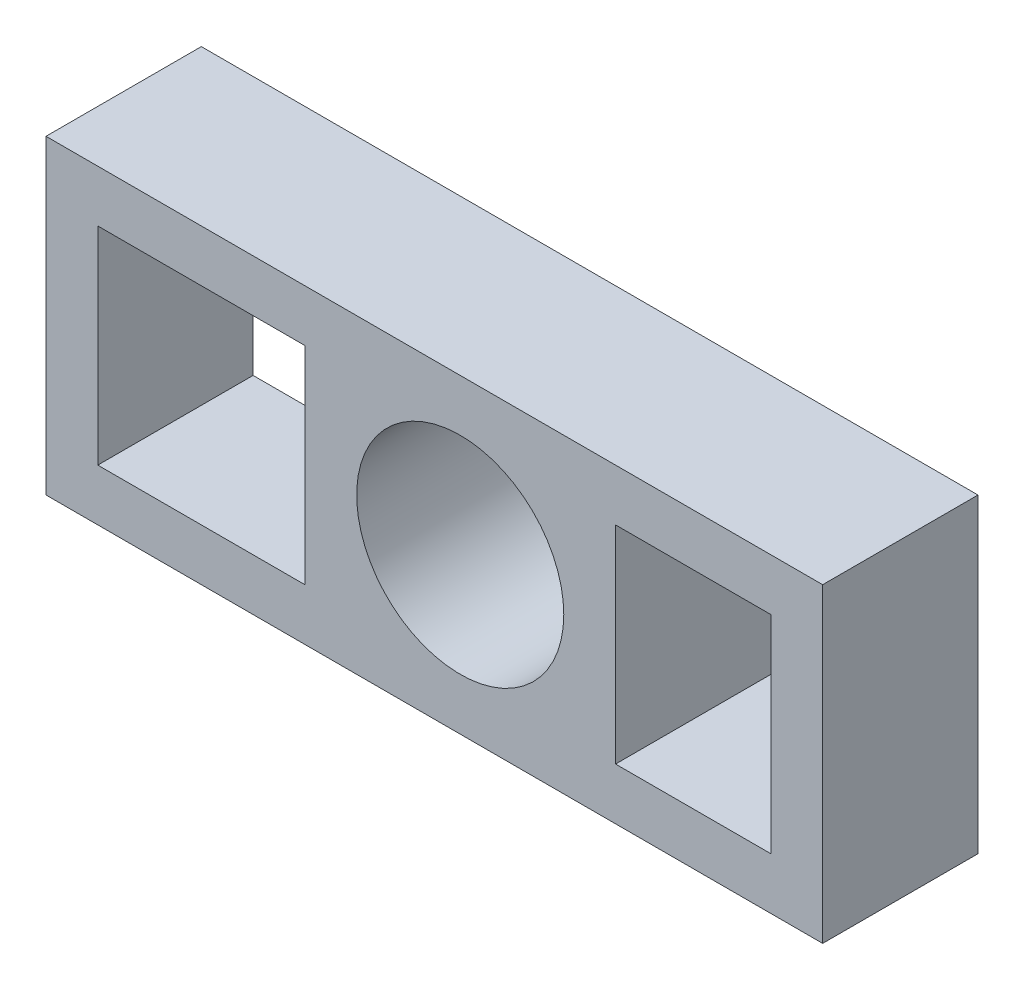
ISO-10303-21;
HEADER;
FILE_DESCRIPTION(('STEP AP214'),'2;1');
FILE_NAME('part.step','',(''),(''),'','','');
FILE_SCHEMA(('AUTOMOTIVE_DESIGN { 1 0 10303 214 1 1 1 1 }'));
ENDSEC;
DATA;
#1=APPLICATION_CONTEXT('core data for automotive mechanical design processes');
#2=APPLICATION_PROTOCOL_DEFINITION('international standard','automotive_design',2000,#1);
#3=PRODUCT_CONTEXT('',#1,'mechanical');
#4=PRODUCT('Part','Part','',(#3));
#5=PRODUCT_RELATED_PRODUCT_CATEGORY('part','',(#4));
#6=PRODUCT_DEFINITION_FORMATION('','',#4);
#7=PRODUCT_DEFINITION_CONTEXT('part definition',#1,'design');
#8=PRODUCT_DEFINITION('design','',#6,#7);
#9=PRODUCT_DEFINITION_SHAPE('','',#8);
#10=(LENGTH_UNIT() NAMED_UNIT(*) SI_UNIT(.MILLI.,.METRE.));
#11=(NAMED_UNIT(*) PLANE_ANGLE_UNIT() SI_UNIT($,.RADIAN.));
#12=(NAMED_UNIT(*) SI_UNIT($,.STERADIAN.) SOLID_ANGLE_UNIT());
#13=UNCERTAINTY_MEASURE_WITH_UNIT(LENGTH_MEASURE(1.E-05),#10,'distance_accuracy_value','');
#14=(GEOMETRIC_REPRESENTATION_CONTEXT(3) GLOBAL_UNCERTAINTY_ASSIGNED_CONTEXT((#13)) GLOBAL_UNIT_ASSIGNED_CONTEXT((#10,
#11,#12)) REPRESENTATION_CONTEXT('',''));
#15=CARTESIAN_POINT('',(0.,0.,0.));
#16=DIRECTION('',(0.,0.,1.));
#17=DIRECTION('',(1.,0.,0.));
#18=AXIS2_PLACEMENT_3D('',#15,#16,#17);
#19=CARTESIAN_POINT('',(0.,0.,381.));
#20=DIRECTION('',(0.,0.,-1.));
#21=DIRECTION('',(-1.,0.,0.));
#22=AXIS2_PLACEMENT_3D('',#19,#20,#21);
#23=PLANE('',#22);
#24=DIRECTION('',(0.,1.,0.));
#25=VECTOR('',#24,1.);
#26=CARTESIAN_POINT('',(635.,635.,381.));
#27=LINE('',#26,#25);
#28=CARTESIAN_POINT('',(635.,127.,381.));
#29=VERTEX_POINT('',#28);
#30=CARTESIAN_POINT('',(635.,635.,381.));
#31=VERTEX_POINT('',#30);
#32=EDGE_CURVE('E182',#29,#31,#27,.T.);
#33=ORIENTED_EDGE('',*,*,#32,.F.);
#34=DIRECTION('',(1.,0.,0.));
#35=VECTOR('',#34,1.);
#36=CARTESIAN_POINT('',(127.,127.,381.));
#37=LINE('',#36,#35);
#38=CARTESIAN_POINT('',(127.,127.,381.));
#39=VERTEX_POINT('',#38);
#40=EDGE_CURVE('E193',#39,#29,#37,.T.);
#41=ORIENTED_EDGE('',*,*,#40,.F.);
#42=DIRECTION('',(0.,-1.,0.));
#43=VECTOR('',#42,1.);
#44=CARTESIAN_POINT('',(127.,635.,381.));
#45=LINE('',#44,#43);
#46=CARTESIAN_POINT('',(127.,635.,381.));
#47=VERTEX_POINT('',#46);
#48=EDGE_CURVE('E189',#47,#39,#45,.T.);
#49=ORIENTED_EDGE('',*,*,#48,.F.);
#50=DIRECTION('',(-1.,0.,0.));
#51=VECTOR('',#50,1.);
#52=CARTESIAN_POINT('',(127.,635.,381.));
#53=LINE('',#52,#51);
#54=EDGE_CURVE('E185',#31,#47,#53,.T.);
#55=ORIENTED_EDGE('',*,*,#54,.F.);
#56=EDGE_LOOP('',(#33,#41,#49,#55));
#57=FACE_BOUND('',#56,.T.);
#58=DIRECTION('',(0.,-1.,0.));
#59=VECTOR('',#58,1.);
#60=CARTESIAN_POINT('',(0.,0.,381.));
#61=LINE('',#60,#59);
#62=CARTESIAN_POINT('',(0.,762.,381.));
#63=VERTEX_POINT('',#62);
#64=CARTESIAN_POINT('',(0.,0.,381.));
#65=VERTEX_POINT('',#64);
#66=EDGE_CURVE('E225',#63,#65,#61,.T.);
#67=ORIENTED_EDGE('',*,*,#66,.T.);
#68=DIRECTION('',(1.,0.,0.));
#69=VECTOR('',#68,1.);
#70=CARTESIAN_POINT('',(0.,0.,381.));
#71=LINE('',#70,#69);
#72=CARTESIAN_POINT('',(1905.,0.,381.));
#73=VERTEX_POINT('',#72);
#74=EDGE_CURVE('E229',#65,#73,#71,.T.);
#75=ORIENTED_EDGE('',*,*,#74,.T.);
#76=DIRECTION('',(0.,1.,0.));
#77=VECTOR('',#76,1.);
#78=CARTESIAN_POINT('',(1905.,0.,381.));
#79=LINE('',#78,#77);
#80=CARTESIAN_POINT('',(1905.,762.,381.));
#81=VERTEX_POINT('',#80);
#82=EDGE_CURVE('E233',#73,#81,#79,.T.);
#83=ORIENTED_EDGE('',*,*,#82,.T.);
#84=DIRECTION('',(-1.,0.,0.));
#85=VECTOR('',#84,1.);
#86=CARTESIAN_POINT('',(0.,762.,381.));
#87=LINE('',#86,#85);
#88=EDGE_CURVE('E236',#81,#63,#87,.T.);
#89=ORIENTED_EDGE('',*,*,#88,.T.);
#90=EDGE_LOOP('',(#67,#75,#83,#89));
#91=FACE_BOUND('',#90,.T.);
#92=DIRECTION('',(0.,-1.,0.));
#93=VECTOR('',#92,1.);
#94=CARTESIAN_POINT('',(1397.,635.,381.));
#95=LINE('',#94,#93);
#96=CARTESIAN_POINT('',(1397.,635.,381.));
#97=VERTEX_POINT('',#96);
#98=CARTESIAN_POINT('',(1397.,127.,381.));
#99=VERTEX_POINT('',#98);
#100=EDGE_CURVE('E131',#97,#99,#95,.T.);
#101=ORIENTED_EDGE('',*,*,#100,.F.);
#102=DIRECTION('',(-1.,0.,0.));
#103=VECTOR('',#102,1.);
#104=CARTESIAN_POINT('',(1397.,635.,381.));
#105=LINE('',#104,#103);
#106=CARTESIAN_POINT('',(1778.,635.,381.));
#107=VERTEX_POINT('',#106);
#108=EDGE_CURVE('E158',#107,#97,#105,.T.);
#109=ORIENTED_EDGE('',*,*,#108,.F.);
#110=DIRECTION('',(0.,1.,0.));
#111=VECTOR('',#110,1.);
#112=CARTESIAN_POINT('',(1778.,635.,381.));
#113=LINE('',#112,#111);
#114=CARTESIAN_POINT('',(1778.,127.,381.));
#115=VERTEX_POINT('',#114);
#116=EDGE_CURVE('E154',#115,#107,#113,.T.);
#117=ORIENTED_EDGE('',*,*,#116,.F.);
#118=DIRECTION('',(1.,0.,0.));
#119=VECTOR('',#118,1.);
#120=CARTESIAN_POINT('',(1397.,127.,381.));
#121=LINE('',#120,#119);
#122=EDGE_CURVE('E140',#99,#115,#121,.T.);
#123=ORIENTED_EDGE('',*,*,#122,.F.);
#124=EDGE_LOOP('',(#101,#109,#117,#123));
#125=FACE_BOUND('',#124,.T.);
#126=CARTESIAN_POINT('',(1016.,381.,381.));
#127=DIRECTION('',(0.,0.,1.));
#128=DIRECTION('',(1.,0.,0.));
#129=AXIS2_PLACEMENT_3D('',#126,#127,#128);
#130=CIRCLE('',#129,254.);
#131=CARTESIAN_POINT('',(1270.,381.,381.));
#132=VERTEX_POINT('',#131);
#133=EDGE_CURVE('E166',#132,#132,#130,.T.);
#134=ORIENTED_EDGE('',*,*,#133,.F.);
#135=EDGE_LOOP('',(#134));
#136=FACE_BOUND('',#135,.T.);
#137=ADVANCED_FACE('F41',(#57,#91,#125,#136),#23,.F.);
#138=CARTESIAN_POINT('',(0.,0.,0.));
#139=DIRECTION('',(0.,0.,-1.));
#140=DIRECTION('',(-1.,0.,0.));
#141=AXIS2_PLACEMENT_3D('',#138,#139,#140);
#142=PLANE('',#141);
#143=DIRECTION('',(-1.,0.,0.));
#144=VECTOR('',#143,1.);
#145=CARTESIAN_POINT('',(1397.,635.,0.));
#146=LINE('',#145,#144);
#147=CARTESIAN_POINT('',(1778.,635.,0.));
#148=VERTEX_POINT('',#147);
#149=CARTESIAN_POINT('',(1397.,635.,0.));
#150=VERTEX_POINT('',#149);
#151=EDGE_CURVE('E141',#148,#150,#146,.T.);
#152=ORIENTED_EDGE('',*,*,#151,.T.);
#153=DIRECTION('',(0.,-1.,0.));
#154=VECTOR('',#153,1.);
#155=CARTESIAN_POINT('',(1397.,635.,0.));
#156=LINE('',#155,#154);
#157=CARTESIAN_POINT('',(1397.,127.,0.));
#158=VERTEX_POINT('',#157);
#159=EDGE_CURVE('E65',#150,#158,#156,.T.);
#160=ORIENTED_EDGE('',*,*,#159,.T.);
#161=DIRECTION('',(1.,0.,0.));
#162=VECTOR('',#161,1.);
#163=CARTESIAN_POINT('',(1397.,127.,0.));
#164=LINE('',#163,#162);
#165=CARTESIAN_POINT('',(1778.,127.,0.));
#166=VERTEX_POINT('',#165);
#167=EDGE_CURVE('E147',#158,#166,#164,.T.);
#168=ORIENTED_EDGE('',*,*,#167,.T.);
#169=DIRECTION('',(0.,1.,0.));
#170=VECTOR('',#169,1.);
#171=CARTESIAN_POINT('',(1778.,635.,0.));
#172=LINE('',#171,#170);
#173=EDGE_CURVE('E169',#166,#148,#172,.T.);
#174=ORIENTED_EDGE('',*,*,#173,.T.);
#175=EDGE_LOOP('',(#152,#160,#168,#174));
#176=FACE_BOUND('',#175,.T.);
#177=DIRECTION('',(1.,0.,0.));
#178=VECTOR('',#177,1.);
#179=CARTESIAN_POINT('',(127.,127.,0.));
#180=LINE('',#179,#178);
#181=CARTESIAN_POINT('',(127.,127.,0.));
#182=VERTEX_POINT('',#181);
#183=CARTESIAN_POINT('',(635.,127.,0.));
#184=VERTEX_POINT('',#183);
#185=EDGE_CURVE('E186',#182,#184,#180,.T.);
#186=ORIENTED_EDGE('',*,*,#185,.T.);
#187=DIRECTION('',(0.,1.,0.));
#188=VECTOR('',#187,1.);
#189=CARTESIAN_POINT('',(635.,635.,0.));
#190=LINE('',#189,#188);
#191=CARTESIAN_POINT('',(635.,635.,0.));
#192=VERTEX_POINT('',#191);
#193=EDGE_CURVE('E149',#184,#192,#190,.T.);
#194=ORIENTED_EDGE('',*,*,#193,.T.);
#195=DIRECTION('',(-1.,0.,0.));
#196=VECTOR('',#195,1.);
#197=CARTESIAN_POINT('',(127.,635.,0.));
#198=LINE('',#197,#196);
#199=CARTESIAN_POINT('',(127.,635.,0.));
#200=VERTEX_POINT('',#199);
#201=EDGE_CURVE('E200',#192,#200,#198,.T.);
#202=ORIENTED_EDGE('',*,*,#201,.T.);
#203=DIRECTION('',(0.,-1.,0.));
#204=VECTOR('',#203,1.);
#205=CARTESIAN_POINT('',(127.,635.,0.));
#206=LINE('',#205,#204);
#207=EDGE_CURVE('E204',#200,#182,#206,.T.);
#208=ORIENTED_EDGE('',*,*,#207,.T.);
#209=EDGE_LOOP('',(#186,#194,#202,#208));
#210=FACE_BOUND('',#209,.T.);
#211=DIRECTION('',(0.,-1.,0.));
#212=VECTOR('',#211,1.);
#213=CARTESIAN_POINT('',(0.,0.,0.));
#214=LINE('',#213,#212);
#215=CARTESIAN_POINT('',(0.,762.,0.));
#216=VERTEX_POINT('',#215);
#217=CARTESIAN_POINT('',(0.,0.,0.));
#218=VERTEX_POINT('',#217);
#219=EDGE_CURVE('E224',#216,#218,#214,.T.);
#220=ORIENTED_EDGE('',*,*,#219,.F.);
#221=DIRECTION('',(-1.,0.,0.));
#222=VECTOR('',#221,1.);
#223=CARTESIAN_POINT('',(0.,762.,0.));
#224=LINE('',#223,#222);
#225=CARTESIAN_POINT('',(1905.,762.,0.));
#226=VERTEX_POINT('',#225);
#227=EDGE_CURVE('E230',#226,#216,#224,.T.);
#228=ORIENTED_EDGE('',*,*,#227,.F.);
#229=DIRECTION('',(0.,1.,0.));
#230=VECTOR('',#229,1.);
#231=CARTESIAN_POINT('',(1905.,0.,0.));
#232=LINE('',#231,#230);
#233=CARTESIAN_POINT('',(1905.,0.,0.));
#234=VERTEX_POINT('',#233);
#235=EDGE_CURVE('E246',#234,#226,#232,.T.);
#236=ORIENTED_EDGE('',*,*,#235,.F.);
#237=DIRECTION('',(1.,0.,0.));
#238=VECTOR('',#237,1.);
#239=CARTESIAN_POINT('',(0.,0.,0.));
#240=LINE('',#239,#238);
#241=EDGE_CURVE('E243',#218,#234,#240,.T.);
#242=ORIENTED_EDGE('',*,*,#241,.F.);
#243=EDGE_LOOP('',(#220,#228,#236,#242));
#244=FACE_BOUND('',#243,.T.);
#245=CARTESIAN_POINT('',(1016.,381.,0.));
#246=DIRECTION('',(0.,0.,1.));
#247=DIRECTION('',(1.,0.,0.));
#248=AXIS2_PLACEMENT_3D('',#245,#246,#247);
#249=CIRCLE('',#248,254.);
#250=CARTESIAN_POINT('',(1270.,381.,0.));
#251=VERTEX_POINT('',#250);
#252=EDGE_CURVE('E350',#251,#251,#249,.T.);
#253=ORIENTED_EDGE('',*,*,#252,.T.);
#254=EDGE_LOOP('',(#253));
#255=FACE_BOUND('',#254,.T.);
#256=ADVANCED_FACE('F269',(#176,#210,#244,#255),#142,.T.);
#257=CARTESIAN_POINT('',(0.,0.,381.));
#258=DIRECTION('',(1.,0.,0.));
#259=DIRECTION('',(0.,0.,-1.));
#260=AXIS2_PLACEMENT_3D('',#257,#258,#259);
#261=PLANE('',#260);
#262=ORIENTED_EDGE('',*,*,#219,.T.);
#263=DIRECTION('',(0.,0.,-1.));
#264=VECTOR('',#263,1.);
#265=CARTESIAN_POINT('',(0.,0.,381.));
#266=LINE('',#265,#264);
#267=EDGE_CURVE('E11',#65,#218,#266,.T.);
#268=ORIENTED_EDGE('',*,*,#267,.F.);
#269=ORIENTED_EDGE('',*,*,#66,.F.);
#270=DIRECTION('',(0.,0.,-1.));
#271=VECTOR('',#270,1.);
#272=CARTESIAN_POINT('',(0.,762.,381.));
#273=LINE('',#272,#271);
#274=EDGE_CURVE('E239',#63,#216,#273,.T.);
#275=ORIENTED_EDGE('',*,*,#274,.T.);
#276=EDGE_LOOP('',(#262,#268,#269,#275));
#277=FACE_BOUND('',#276,.T.);
#278=ADVANCED_FACE('F43',(#277),#261,.F.);
#279=CARTESIAN_POINT('',(0.,0.,381.));
#280=DIRECTION('',(0.,1.,0.));
#281=DIRECTION('',(0.,0.,1.));
#282=AXIS2_PLACEMENT_3D('',#279,#280,#281);
#283=PLANE('',#282);
#284=ORIENTED_EDGE('',*,*,#241,.T.);
#285=DIRECTION('',(0.,0.,-1.));
#286=VECTOR('',#285,1.);
#287=CARTESIAN_POINT('',(1905.,0.,381.));
#288=LINE('',#287,#286);
#289=EDGE_CURVE('E50',#73,#234,#288,.T.);
#290=ORIENTED_EDGE('',*,*,#289,.F.);
#291=ORIENTED_EDGE('',*,*,#74,.F.);
#292=ORIENTED_EDGE('',*,*,#267,.T.);
#293=EDGE_LOOP('',(#284,#290,#291,#292));
#294=FACE_BOUND('',#293,.T.);
#295=ADVANCED_FACE('F279',(#294),#283,.F.);
#296=CARTESIAN_POINT('',(1905.,0.,381.));
#297=DIRECTION('',(-1.,0.,0.));
#298=DIRECTION('',(0.,0.,1.));
#299=AXIS2_PLACEMENT_3D('',#296,#297,#298);
#300=PLANE('',#299);
#301=ORIENTED_EDGE('',*,*,#235,.T.);
#302=DIRECTION('',(0.,0.,-1.));
#303=VECTOR('',#302,1.);
#304=CARTESIAN_POINT('',(1905.,762.,381.));
#305=LINE('',#304,#303);
#306=EDGE_CURVE('E254',#81,#226,#305,.T.);
#307=ORIENTED_EDGE('',*,*,#306,.F.);
#308=ORIENTED_EDGE('',*,*,#82,.F.);
#309=ORIENTED_EDGE('',*,*,#289,.T.);
#310=EDGE_LOOP('',(#301,#307,#308,#309));
#311=FACE_BOUND('',#310,.T.);
#312=ADVANCED_FACE('F263',(#311),#300,.F.);
#313=CARTESIAN_POINT('',(0.,762.,381.));
#314=DIRECTION('',(0.,-1.,0.));
#315=DIRECTION('',(0.,0.,-1.));
#316=AXIS2_PLACEMENT_3D('',#313,#314,#315);
#317=PLANE('',#316);
#318=ORIENTED_EDGE('',*,*,#227,.T.);
#319=ORIENTED_EDGE('',*,*,#274,.F.);
#320=ORIENTED_EDGE('',*,*,#88,.F.);
#321=ORIENTED_EDGE('',*,*,#306,.T.);
#322=EDGE_LOOP('',(#318,#319,#320,#321));
#323=FACE_BOUND('',#322,.T.);
#324=ADVANCED_FACE('F273',(#323),#317,.F.);
#325=CARTESIAN_POINT('',(635.,635.,381.));
#326=DIRECTION('',(-1.,0.,0.));
#327=DIRECTION('',(0.,-1.,0.));
#328=AXIS2_PLACEMENT_3D('',#325,#326,#327);
#329=PLANE('',#328);
#330=ORIENTED_EDGE('',*,*,#193,.F.);
#331=DIRECTION('',(0.,0.,-1.));
#332=VECTOR('',#331,1.);
#333=CARTESIAN_POINT('',(635.,127.,381.));
#334=LINE('',#333,#332);
#335=EDGE_CURVE('E196',#29,#184,#334,.T.);
#336=ORIENTED_EDGE('',*,*,#335,.F.);
#337=ORIENTED_EDGE('',*,*,#32,.T.);
#338=DIRECTION('',(0.,0.,-1.));
#339=VECTOR('',#338,1.);
#340=CARTESIAN_POINT('',(635.,635.,381.));
#341=LINE('',#340,#339);
#342=EDGE_CURVE('E220',#31,#192,#341,.T.);
#343=ORIENTED_EDGE('',*,*,#342,.T.);
#344=EDGE_LOOP('',(#330,#336,#337,#343));
#345=FACE_BOUND('',#344,.T.);
#346=ADVANCED_FACE('F296',(#345),#329,.T.);
#347=CARTESIAN_POINT('',(127.,635.,381.));
#348=DIRECTION('',(0.,-1.,0.));
#349=DIRECTION('',(0.,0.,-1.));
#350=AXIS2_PLACEMENT_3D('',#347,#348,#349);
#351=PLANE('',#350);
#352=ORIENTED_EDGE('',*,*,#201,.F.);
#353=ORIENTED_EDGE('',*,*,#342,.F.);
#354=ORIENTED_EDGE('',*,*,#54,.T.);
#355=DIRECTION('',(0.,0.,-1.));
#356=VECTOR('',#355,1.);
#357=CARTESIAN_POINT('',(127.,635.,381.));
#358=LINE('',#357,#356);
#359=EDGE_CURVE('E217',#47,#200,#358,.T.);
#360=ORIENTED_EDGE('',*,*,#359,.T.);
#361=EDGE_LOOP('',(#352,#353,#354,#360));
#362=FACE_BOUND('',#361,.T.);
#363=ADVANCED_FACE('F303',(#362),#351,.T.);
#364=CARTESIAN_POINT('',(127.,635.,381.));
#365=DIRECTION('',(1.,0.,0.));
#366=DIRECTION('',(0.,1.,0.));
#367=AXIS2_PLACEMENT_3D('',#364,#365,#366);
#368=PLANE('',#367);
#369=ORIENTED_EDGE('',*,*,#207,.F.);
#370=ORIENTED_EDGE('',*,*,#359,.F.);
#371=ORIENTED_EDGE('',*,*,#48,.T.);
#372=DIRECTION('',(0.,0.,-1.));
#373=VECTOR('',#372,1.);
#374=CARTESIAN_POINT('',(127.,127.,381.));
#375=LINE('',#374,#373);
#376=EDGE_CURVE('E214',#39,#182,#375,.T.);
#377=ORIENTED_EDGE('',*,*,#376,.T.);
#378=EDGE_LOOP('',(#369,#370,#371,#377));
#379=FACE_BOUND('',#378,.T.);
#380=ADVANCED_FACE('F308',(#379),#368,.T.);
#381=CARTESIAN_POINT('',(127.,127.,381.));
#382=DIRECTION('',(0.,1.,0.));
#383=DIRECTION('',(0.,0.,1.));
#384=AXIS2_PLACEMENT_3D('',#381,#382,#383);
#385=PLANE('',#384);
#386=ORIENTED_EDGE('',*,*,#185,.F.);
#387=ORIENTED_EDGE('',*,*,#376,.F.);
#388=ORIENTED_EDGE('',*,*,#40,.T.);
#389=ORIENTED_EDGE('',*,*,#335,.T.);
#390=EDGE_LOOP('',(#386,#387,#388,#389));
#391=FACE_BOUND('',#390,.T.);
#392=ADVANCED_FACE('F315',(#391),#385,.T.);
#393=CARTESIAN_POINT('',(1397.,635.,381.));
#394=DIRECTION('',(1.,0.,0.));
#395=DIRECTION('',(0.,0.,-1.));
#396=AXIS2_PLACEMENT_3D('',#393,#394,#395);
#397=PLANE('',#396);
#398=ORIENTED_EDGE('',*,*,#159,.F.);
#399=DIRECTION('',(0.,0.,-1.));
#400=VECTOR('',#399,1.);
#401=CARTESIAN_POINT('',(1397.,635.,381.));
#402=LINE('',#401,#400);
#403=EDGE_CURVE('E135',#97,#150,#402,.T.);
#404=ORIENTED_EDGE('',*,*,#403,.F.);
#405=ORIENTED_EDGE('',*,*,#100,.T.);
#406=DIRECTION('',(0.,0.,-1.));
#407=VECTOR('',#406,1.);
#408=CARTESIAN_POINT('',(1397.,127.,381.));
#409=LINE('',#408,#407);
#410=EDGE_CURVE('E134',#99,#158,#409,.T.);
#411=ORIENTED_EDGE('',*,*,#410,.T.);
#412=EDGE_LOOP('',(#398,#404,#405,#411));
#413=FACE_BOUND('',#412,.T.);
#414=ADVANCED_FACE('F133',(#413),#397,.T.);
#415=CARTESIAN_POINT('',(1397.,127.,381.));
#416=DIRECTION('',(0.,1.,0.));
#417=DIRECTION('',(0.,0.,1.));
#418=AXIS2_PLACEMENT_3D('',#415,#416,#417);
#419=PLANE('',#418);
#420=ORIENTED_EDGE('',*,*,#167,.F.);
#421=ORIENTED_EDGE('',*,*,#410,.F.);
#422=ORIENTED_EDGE('',*,*,#122,.T.);
#423=DIRECTION('',(0.,0.,-1.));
#424=VECTOR('',#423,1.);
#425=CARTESIAN_POINT('',(1778.,127.,381.));
#426=LINE('',#425,#424);
#427=EDGE_CURVE('E150',#115,#166,#426,.T.);
#428=ORIENTED_EDGE('',*,*,#427,.T.);
#429=EDGE_LOOP('',(#420,#421,#422,#428));
#430=FACE_BOUND('',#429,.T.);
#431=ADVANCED_FACE('F144',(#430),#419,.T.);
#432=CARTESIAN_POINT('',(1778.,635.,381.));
#433=DIRECTION('',(-1.,0.,0.));
#434=DIRECTION('',(0.,0.,1.));
#435=AXIS2_PLACEMENT_3D('',#432,#433,#434);
#436=PLANE('',#435);
#437=ORIENTED_EDGE('',*,*,#173,.F.);
#438=ORIENTED_EDGE('',*,*,#427,.F.);
#439=ORIENTED_EDGE('',*,*,#116,.T.);
#440=DIRECTION('',(0.,0.,-1.));
#441=VECTOR('',#440,1.);
#442=CARTESIAN_POINT('',(1778.,635.,381.));
#443=LINE('',#442,#441);
#444=EDGE_CURVE('E57',#107,#148,#443,.T.);
#445=ORIENTED_EDGE('',*,*,#444,.T.);
#446=EDGE_LOOP('',(#437,#438,#439,#445));
#447=FACE_BOUND('',#446,.T.);
#448=ADVANCED_FACE('F333',(#447),#436,.T.);
#449=CARTESIAN_POINT('',(1397.,635.,381.));
#450=DIRECTION('',(0.,-1.,0.));
#451=DIRECTION('',(0.,0.,-1.));
#452=AXIS2_PLACEMENT_3D('',#449,#450,#451);
#453=PLANE('',#452);
#454=ORIENTED_EDGE('',*,*,#151,.F.);
#455=ORIENTED_EDGE('',*,*,#444,.F.);
#456=ORIENTED_EDGE('',*,*,#108,.T.);
#457=ORIENTED_EDGE('',*,*,#403,.T.);
#458=EDGE_LOOP('',(#454,#455,#456,#457));
#459=FACE_BOUND('',#458,.T.);
#460=ADVANCED_FACE('F336',(#459),#453,.T.);
#461=CARTESIAN_POINT('',(1016.,381.,381.));
#462=DIRECTION('',(0.,0.,-1.));
#463=DIRECTION('',(-1.,0.,0.));
#464=AXIS2_PLACEMENT_3D('',#461,#462,#463);
#465=CYLINDRICAL_SURFACE('',#464,254.);
#466=ORIENTED_EDGE('',*,*,#133,.T.);
#467=EDGE_LOOP('',(#466));
#468=FACE_BOUND('',#467,.T.);
#469=ORIENTED_EDGE('',*,*,#252,.F.);
#470=EDGE_LOOP('',(#469));
#471=FACE_BOUND('',#470,.T.);
#472=ADVANCED_FACE('F340',(#468,#471),#465,.F.);
#473=CLOSED_SHELL('',(#137,#256,#278,#295,#312,#324,#346,#363,#380,#392,#414,#431,#448,#460,#472));
#474=MANIFOLD_SOLID_BREP('B2',#473);
#475=ADVANCED_BREP_SHAPE_REPRESENTATION('',(#18,#474),#14);
#476=SHAPE_DEFINITION_REPRESENTATION(#9,#475);
ENDSEC;
END-ISO-10303-21;
